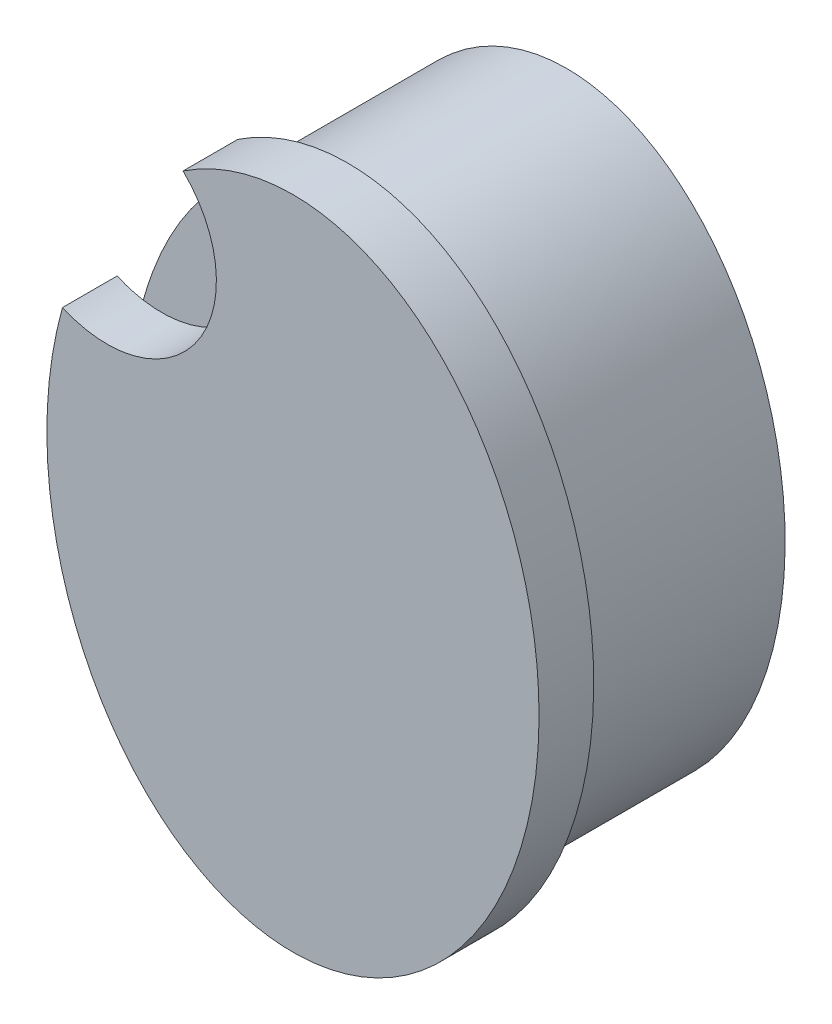
ISO-10303-21;
HEADER;
FILE_DESCRIPTION(('STEP AP214'),'2;1');
FILE_NAME('part.step','',(''),(''),'','','');
FILE_SCHEMA(('AUTOMOTIVE_DESIGN { 1 0 10303 214 1 1 1 1 }'));
ENDSEC;
DATA;
#1=APPLICATION_CONTEXT('core data for automotive mechanical design processes');
#2=APPLICATION_PROTOCOL_DEFINITION('international standard','automotive_design',2000,#1);
#3=PRODUCT_CONTEXT('',#1,'mechanical');
#4=PRODUCT('Part','Part','',(#3));
#5=PRODUCT_RELATED_PRODUCT_CATEGORY('part','',(#4));
#6=PRODUCT_DEFINITION_FORMATION('','',#4);
#7=PRODUCT_DEFINITION_CONTEXT('part definition',#1,'design');
#8=PRODUCT_DEFINITION('design','',#6,#7);
#9=PRODUCT_DEFINITION_SHAPE('','',#8);
#10=(LENGTH_UNIT() NAMED_UNIT(*) SI_UNIT(.MILLI.,.METRE.));
#11=(NAMED_UNIT(*) PLANE_ANGLE_UNIT() SI_UNIT($,.RADIAN.));
#12=(NAMED_UNIT(*) SI_UNIT($,.STERADIAN.) SOLID_ANGLE_UNIT());
#13=UNCERTAINTY_MEASURE_WITH_UNIT(LENGTH_MEASURE(1.E-05),#10,'distance_accuracy_value','');
#14=(GEOMETRIC_REPRESENTATION_CONTEXT(3) GLOBAL_UNCERTAINTY_ASSIGNED_CONTEXT((#13)) GLOBAL_UNIT_ASSIGNED_CONTEXT((#10,
#11,#12)) REPRESENTATION_CONTEXT('',''));
#15=CARTESIAN_POINT('',(0.,0.,0.));
#16=DIRECTION('',(0.,0.,1.));
#17=DIRECTION('',(1.,0.,0.));
#18=AXIS2_PLACEMENT_3D('',#15,#16,#17);
#19=CARTESIAN_POINT('',(0.,0.,8.));
#20=DIRECTION('',(0.,0.,1.));
#21=DIRECTION('',(0.,1.,0.));
#22=AXIS2_PLACEMENT_3D('',#19,#20,#21);
#23=ELLIPSE('',#22,11.,8.);
#24=DIRECTION('',(0.,0.,-1.));
#25=VECTOR('',#24,1.);
#26=SURFACE_OF_LINEAR_EXTRUSION('',#23,#25);
#27=CARTESIAN_POINT('',(-3.39553726281056,9.96000559293319,8.));
#28=VERTEX_POINT('',#27);
#29=CARTESIAN_POINT('',(-7.47534985654934,3.91794048094933,8.));
#30=VERTEX_POINT('',#29);
#31=EDGE_CURVE('E41',#28,#30,#23,.T.);
#32=ORIENTED_EDGE('',*,*,#31,.F.);
#33=EDGE_CURVE('E80',#30,#28,#23,.T.);
#34=ORIENTED_EDGE('',*,*,#33,.F.);
#35=EDGE_LOOP('',(#32,#34));
#36=FACE_BOUND('',#35,.T.);
#37=CARTESIAN_POINT('',(0.,0.,0.));
#38=DIRECTION('',(0.,0.,1.));
#39=DIRECTION('',(0.,1.,0.));
#40=AXIS2_PLACEMENT_3D('',#37,#38,#39);
#41=ELLIPSE('',#40,11.,8.);
#42=CARTESIAN_POINT('',(0.,11.,0.));
#43=VERTEX_POINT('',#42);
#44=EDGE_CURVE('E86',#43,#43,#41,.T.);
#45=ORIENTED_EDGE('',*,*,#44,.T.);
#46=EDGE_LOOP('',(#45));
#47=FACE_BOUND('',#46,.T.);
#48=ADVANCED_FACE('F33',(#36,#47),#26,.F.);
#49=CARTESIAN_POINT('',(0.,0.,0.));
#50=DIRECTION('',(0.,0.,1.));
#51=DIRECTION('',(1.,0.,0.));
#52=AXIS2_PLACEMENT_3D('',#49,#50,#51);
#53=PLANE('',#52);
#54=ORIENTED_EDGE('',*,*,#44,.F.);
#55=EDGE_LOOP('',(#54));
#56=FACE_BOUND('',#55,.T.);
#57=ADVANCED_FACE('F95',(#56),#53,.F.);
#58=CARTESIAN_POINT('',(0.,0.,10.));
#59=DIRECTION('',(0.,0.,1.));
#60=DIRECTION('',(0.,1.,0.));
#61=AXIS2_PLACEMENT_3D('',#58,#59,#60);
#62=ELLIPSE('',#61,12.,9.);
#63=DIRECTION('',(0.,0.,-1.));
#64=VECTOR('',#63,1.);
#65=SURFACE_OF_LINEAR_EXTRUSION('',#62,#64);
#66=CARTESIAN_POINT('',(-8.42876571698613,4.20706463794396,10.));
#67=VERTEX_POINT('',#66);
#68=CARTESIAN_POINT('',(-4.02005051010537,10.7363717352601,10.));
#69=VERTEX_POINT('',#68);
#70=EDGE_CURVE('E84',#67,#69,#62,.T.);
#71=ORIENTED_EDGE('',*,*,#70,.F.);
#72=DIRECTION('',(0.,0.,1.));
#73=VECTOR('',#72,1.);
#74=CARTESIAN_POINT('',(-8.42876571698613,4.20706463794396,8.));
#75=LINE('',#74,#73);
#76=CARTESIAN_POINT('',(-8.42876571698613,4.20706463794396,8.));
#77=VERTEX_POINT('',#76);
#78=EDGE_CURVE('E70',#77,#67,#75,.T.);
#79=ORIENTED_EDGE('',*,*,#78,.F.);
#80=CARTESIAN_POINT('',(0.,0.,8.));
#81=DIRECTION('',(0.,0.,1.));
#82=DIRECTION('',(0.,1.,0.));
#83=AXIS2_PLACEMENT_3D('',#80,#81,#82);
#84=ELLIPSE('',#83,12.,9.);
#85=CARTESIAN_POINT('',(-4.02005051010537,10.7363717352601,8.));
#86=VERTEX_POINT('',#85);
#87=EDGE_CURVE('E78',#77,#86,#84,.T.);
#88=ORIENTED_EDGE('',*,*,#87,.T.);
#89=DIRECTION('',(0.,0.,1.));
#90=VECTOR('',#89,1.);
#91=CARTESIAN_POINT('',(-4.02005051010537,10.7363717352601,8.));
#92=LINE('',#91,#90);
#93=EDGE_CURVE('E62',#86,#69,#92,.T.);
#94=ORIENTED_EDGE('',*,*,#93,.T.);
#95=EDGE_LOOP('',(#71,#79,#88,#94));
#96=FACE_BOUND('',#95,.T.);
#97=ADVANCED_FACE('F83',(#96),#65,.F.);
#98=CARTESIAN_POINT('',(0.,0.,10.));
#99=DIRECTION('',(0.,0.,1.));
#100=DIRECTION('',(1.,0.,0.));
#101=AXIS2_PLACEMENT_3D('',#98,#99,#100);
#102=PLANE('',#101);
#103=CARTESIAN_POINT('',(-6.8002918453515,7.86056608852578,10.));
#104=DIRECTION('',(0.,0.,1.));
#105=DIRECTION('',(1.,0.,0.));
#106=AXIS2_PLACEMENT_3D('',#103,#104,#105);
#107=CIRCLE('',#106,4.);
#108=EDGE_CURVE('E65',#67,#69,#107,.T.);
#109=ORIENTED_EDGE('',*,*,#108,.F.);
#110=ORIENTED_EDGE('',*,*,#70,.T.);
#111=EDGE_LOOP('',(#109,#110));
#112=FACE_BOUND('',#111,.T.);
#113=ADVANCED_FACE('F101',(#112),#102,.T.);
#114=CARTESIAN_POINT('',(0.,0.,8.));
#115=DIRECTION('',(0.,0.,1.));
#116=DIRECTION('',(1.,0.,0.));
#117=AXIS2_PLACEMENT_3D('',#114,#115,#116);
#118=PLANE('',#117);
#119=ORIENTED_EDGE('',*,*,#33,.T.);
#120=CARTESIAN_POINT('',(-6.8002918453515,7.86056608852578,8.));
#121=DIRECTION('',(0.,0.,1.));
#122=DIRECTION('',(1.,0.,0.));
#123=AXIS2_PLACEMENT_3D('',#120,#121,#122);
#124=CIRCLE('',#123,4.);
#125=EDGE_CURVE('E11',#28,#86,#124,.T.);
#126=ORIENTED_EDGE('',*,*,#125,.T.);
#127=ORIENTED_EDGE('',*,*,#87,.F.);
#128=CARTESIAN_POINT('',(-6.8002918453515,7.86056608852578,8.));
#129=DIRECTION('',(0.,0.,1.));
#130=DIRECTION('',(1.,0.,0.));
#131=AXIS2_PLACEMENT_3D('',#128,#129,#130);
#132=CIRCLE('',#131,4.);
#133=EDGE_CURVE('E71',#77,#30,#132,.T.);
#134=ORIENTED_EDGE('',*,*,#133,.T.);
#135=EDGE_LOOP('',(#119,#126,#127,#134));
#136=FACE_BOUND('',#135,.T.);
#137=ADVANCED_FACE('F76',(#136),#118,.F.);
#138=CARTESIAN_POINT('',(0.,0.,8.));
#139=DIRECTION('',(0.,0.,1.));
#140=DIRECTION('',(1.,0.,0.));
#141=AXIS2_PLACEMENT_3D('',#138,#139,#140);
#142=PLANE('',#141);
#143=ORIENTED_EDGE('',*,*,#31,.T.);
#144=EDGE_CURVE('E48',#30,#28,#132,.T.);
#145=ORIENTED_EDGE('',*,*,#144,.T.);
#146=EDGE_LOOP('',(#143,#145));
#147=FACE_BOUND('',#146,.T.);
#148=ADVANCED_FACE('F107',(#147),#142,.T.);
#149=CARTESIAN_POINT('',(-6.8002918453515,7.86056608852578,8.));
#150=DIRECTION('',(0.,0.,1.));
#151=DIRECTION('',(1.,0.,0.));
#152=AXIS2_PLACEMENT_3D('',#149,#150,#151);
#153=CYLINDRICAL_SURFACE('',#152,4.);
#154=ORIENTED_EDGE('',*,*,#108,.T.);
#155=ORIENTED_EDGE('',*,*,#93,.F.);
#156=ORIENTED_EDGE('',*,*,#125,.F.);
#157=ORIENTED_EDGE('',*,*,#144,.F.);
#158=ORIENTED_EDGE('',*,*,#133,.F.);
#159=ORIENTED_EDGE('',*,*,#78,.T.);
#160=EDGE_LOOP('',(#154,#155,#156,#157,#158,#159));
#161=FACE_BOUND('',#160,.T.);
#162=ADVANCED_FACE('F63',(#161),#153,.F.);
#163=CLOSED_SHELL('',(#48,#57,#97,#113,#137,#148,#162));
#164=MANIFOLD_SOLID_BREP('B2',#163);
#165=ADVANCED_BREP_SHAPE_REPRESENTATION('',(#18,#164),#14);
#166=SHAPE_DEFINITION_REPRESENTATION(#9,#165);
ENDSEC;
END-ISO-10303-21;
